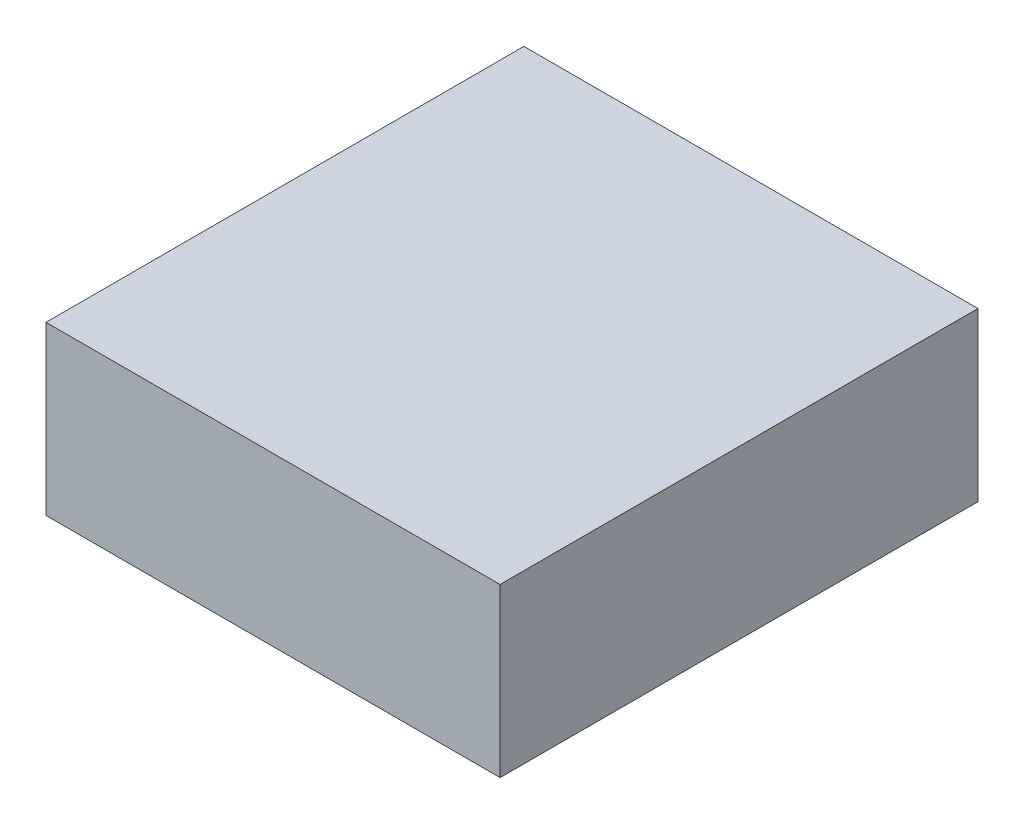
ISO-10303-21;
HEADER;
FILE_DESCRIPTION(('STEP AP214'),'2;1');
FILE_NAME('part.step','',(''),(''),'','','');
FILE_SCHEMA(('AUTOMOTIVE_DESIGN { 1 0 10303 214 1 1 1 1 }'));
ENDSEC;
DATA;
#1=APPLICATION_CONTEXT('core data for automotive mechanical design processes');
#2=APPLICATION_PROTOCOL_DEFINITION('international standard','automotive_design',2000,#1);
#3=PRODUCT_CONTEXT('',#1,'mechanical');
#4=PRODUCT('Part','Part','',(#3));
#5=PRODUCT_RELATED_PRODUCT_CATEGORY('part','',(#4));
#6=PRODUCT_DEFINITION_FORMATION('','',#4);
#7=PRODUCT_DEFINITION_CONTEXT('part definition',#1,'design');
#8=PRODUCT_DEFINITION('design','',#6,#7);
#9=PRODUCT_DEFINITION_SHAPE('','',#8);
#10=(LENGTH_UNIT() NAMED_UNIT(*) SI_UNIT(.MILLI.,.METRE.));
#11=(NAMED_UNIT(*) PLANE_ANGLE_UNIT() SI_UNIT($,.RADIAN.));
#12=(NAMED_UNIT(*) SI_UNIT($,.STERADIAN.) SOLID_ANGLE_UNIT());
#13=UNCERTAINTY_MEASURE_WITH_UNIT(LENGTH_MEASURE(1.E-05),#10,'distance_accuracy_value','');
#14=(GEOMETRIC_REPRESENTATION_CONTEXT(3) GLOBAL_UNCERTAINTY_ASSIGNED_CONTEXT((#13)) GLOBAL_UNIT_ASSIGNED_CONTEXT((#10,
#11,#12)) REPRESENTATION_CONTEXT('',''));
#15=CARTESIAN_POINT('',(0.,0.,0.));
#16=DIRECTION('',(0.,0.,1.));
#17=DIRECTION('',(1.,0.,0.));
#18=AXIS2_PLACEMENT_3D('',#15,#16,#17);
#19=CARTESIAN_POINT('',(0.47500032,0.17500092,0.));
#20=DIRECTION('',(0.,-1.,0.));
#21=DIRECTION('',(0.,0.,-1.));
#22=AXIS2_PLACEMENT_3D('',#19,#20,#21);
#23=PLANE('',#22);
#24=DIRECTION('',(0.,0.,-1.));
#25=VECTOR('',#24,1.);
#26=CARTESIAN_POINT('',(-0.47499778,0.17500092,0.));
#27=LINE('',#26,#25);
#28=CARTESIAN_POINT('',(-0.47499778,0.17500092,0.));
#29=VERTEX_POINT('',#28);
#30=CARTESIAN_POINT('',(-0.47499778,0.17500092,1.00000054));
#31=VERTEX_POINT('',#30);
#32=EDGE_CURVE('E20',#29,#31,#27,.F.);
#33=ORIENTED_EDGE('',*,*,#32,.T.);
#34=DIRECTION('',(-1.,0.,0.));
#35=VECTOR('',#34,1.);
#36=CARTESIAN_POINT('',(-0.47499778,0.17500092,1.00000054));
#37=LINE('',#36,#35);
#38=CARTESIAN_POINT('',(0.47500032,0.17500092,1.00000054));
#39=VERTEX_POINT('',#38);
#40=EDGE_CURVE('E55',#31,#39,#37,.F.);
#41=ORIENTED_EDGE('',*,*,#40,.T.);
#42=DIRECTION('',(0.,0.,1.));
#43=VECTOR('',#42,1.);
#44=CARTESIAN_POINT('',(0.47500032,0.17500092,0.));
#45=LINE('',#44,#43);
#46=CARTESIAN_POINT('',(0.47500032,0.17500092,0.));
#47=VERTEX_POINT('',#46);
#48=EDGE_CURVE('E76',#39,#47,#45,.F.);
#49=ORIENTED_EDGE('',*,*,#48,.T.);
#50=DIRECTION('',(-1.,0.,0.));
#51=VECTOR('',#50,1.);
#52=CARTESIAN_POINT('',(-0.47499778,0.17500092,0.));
#53=LINE('',#52,#51);
#54=EDGE_CURVE('E58',#29,#47,#53,.F.);
#55=ORIENTED_EDGE('',*,*,#54,.F.);
#56=EDGE_LOOP('',(#33,#41,#49,#55));
#57=FACE_BOUND('',#56,.T.);
#58=ADVANCED_FACE('F17',(#57),#23,.F.);
#59=CARTESIAN_POINT('',(-0.47499778,0.17500092,0.));
#60=DIRECTION('',(1.,0.,0.));
#61=DIRECTION('',(0.,0.,-1.));
#62=AXIS2_PLACEMENT_3D('',#59,#60,#61);
#63=PLANE('',#62);
#64=DIRECTION('',(0.,0.,1.));
#65=VECTOR('',#64,1.);
#66=CARTESIAN_POINT('',(-0.47499778,-0.17500092,0.));
#67=LINE('',#66,#65);
#68=CARTESIAN_POINT('',(-0.47499778,-0.17500092,0.));
#69=VERTEX_POINT('',#68);
#70=CARTESIAN_POINT('',(-0.47499778,-0.17500092,1.00000054));
#71=VERTEX_POINT('',#70);
#72=EDGE_CURVE('E73',#69,#71,#67,.T.);
#73=ORIENTED_EDGE('',*,*,#72,.T.);
#74=DIRECTION('',(0.,1.,0.));
#75=VECTOR('',#74,1.);
#76=CARTESIAN_POINT('',(-0.47499778,-0.17500092,1.00000054));
#77=LINE('',#76,#75);
#78=EDGE_CURVE('E63',#71,#31,#77,.T.);
#79=ORIENTED_EDGE('',*,*,#78,.T.);
#80=ORIENTED_EDGE('',*,*,#32,.F.);
#81=DIRECTION('',(0.,1.,0.));
#82=VECTOR('',#81,1.);
#83=CARTESIAN_POINT('',(-0.47499778,-0.17500092,0.));
#84=LINE('',#83,#82);
#85=EDGE_CURVE('E78',#69,#29,#84,.T.);
#86=ORIENTED_EDGE('',*,*,#85,.F.);
#87=EDGE_LOOP('',(#73,#79,#80,#86));
#88=FACE_BOUND('',#87,.T.);
#89=ADVANCED_FACE('F72',(#88),#63,.F.);
#90=CARTESIAN_POINT('',(-0.47499778,-0.17500092,1.00000054));
#91=DIRECTION('',(0.,0.,-1.));
#92=DIRECTION('',(-1.,0.,0.));
#93=AXIS2_PLACEMENT_3D('',#90,#91,#92);
#94=PLANE('',#93);
#95=DIRECTION('',(0.,1.,0.));
#96=VECTOR('',#95,1.);
#97=CARTESIAN_POINT('',(0.47500032,-0.17500092,1.00000054));
#98=LINE('',#97,#96);
#99=CARTESIAN_POINT('',(0.47500032,-0.17500092,1.00000054));
#100=VERTEX_POINT('',#99);
#101=EDGE_CURVE('E69',#100,#39,#98,.T.);
#102=ORIENTED_EDGE('',*,*,#101,.T.);
#103=ORIENTED_EDGE('',*,*,#40,.F.);
#104=ORIENTED_EDGE('',*,*,#78,.F.);
#105=DIRECTION('',(1.,0.,0.));
#106=VECTOR('',#105,1.);
#107=CARTESIAN_POINT('',(-0.47499778,-0.17500092,1.00000054));
#108=LINE('',#107,#106);
#109=EDGE_CURVE('E83',#71,#100,#108,.T.);
#110=ORIENTED_EDGE('',*,*,#109,.T.);
#111=EDGE_LOOP('',(#102,#103,#104,#110));
#112=FACE_BOUND('',#111,.T.);
#113=ADVANCED_FACE('F66',(#112),#94,.F.);
#114=CARTESIAN_POINT('',(0.47500032,-0.17500092,0.));
#115=DIRECTION('',(-1.,0.,0.));
#116=DIRECTION('',(0.,0.,1.));
#117=AXIS2_PLACEMENT_3D('',#114,#115,#116);
#118=PLANE('',#117);
#119=ORIENTED_EDGE('',*,*,#48,.F.);
#120=ORIENTED_EDGE('',*,*,#101,.F.);
#121=DIRECTION('',(0.,0.,1.));
#122=VECTOR('',#121,1.);
#123=CARTESIAN_POINT('',(0.47500032,-0.17500092,0.));
#124=LINE('',#123,#122);
#125=CARTESIAN_POINT('',(0.47500032,-0.17500092,0.));
#126=VERTEX_POINT('',#125);
#127=EDGE_CURVE('E26',#100,#126,#124,.F.);
#128=ORIENTED_EDGE('',*,*,#127,.T.);
#129=DIRECTION('',(0.,1.,0.));
#130=VECTOR('',#129,1.);
#131=CARTESIAN_POINT('',(0.47500032,-0.17500092,0.));
#132=LINE('',#131,#130);
#133=EDGE_CURVE('E34',#47,#126,#132,.F.);
#134=ORIENTED_EDGE('',*,*,#133,.F.);
#135=EDGE_LOOP('',(#119,#120,#128,#134));
#136=FACE_BOUND('',#135,.T.);
#137=ADVANCED_FACE('F88',(#136),#118,.F.);
#138=CARTESIAN_POINT('',(-0.47499778,-0.17500092,0.));
#139=DIRECTION('',(0.,0.,-1.));
#140=DIRECTION('',(-1.,0.,0.));
#141=AXIS2_PLACEMENT_3D('',#138,#139,#140);
#142=PLANE('',#141);
#143=ORIENTED_EDGE('',*,*,#133,.T.);
#144=DIRECTION('',(1.,0.,0.));
#145=VECTOR('',#144,1.);
#146=CARTESIAN_POINT('',(-0.47499778,-0.17500092,0.));
#147=LINE('',#146,#145);
#148=EDGE_CURVE('E11',#126,#69,#147,.F.);
#149=ORIENTED_EDGE('',*,*,#148,.T.);
#150=ORIENTED_EDGE('',*,*,#85,.T.);
#151=ORIENTED_EDGE('',*,*,#54,.T.);
#152=EDGE_LOOP('',(#143,#149,#150,#151));
#153=FACE_BOUND('',#152,.T.);
#154=ADVANCED_FACE('F91',(#153),#142,.T.);
#155=CARTESIAN_POINT('',(-0.47499778,-0.17500092,0.));
#156=DIRECTION('',(0.,1.,0.));
#157=DIRECTION('',(0.,0.,1.));
#158=AXIS2_PLACEMENT_3D('',#155,#156,#157);
#159=PLANE('',#158);
#160=ORIENTED_EDGE('',*,*,#127,.F.);
#161=ORIENTED_EDGE('',*,*,#109,.F.);
#162=ORIENTED_EDGE('',*,*,#72,.F.);
#163=ORIENTED_EDGE('',*,*,#148,.F.);
#164=EDGE_LOOP('',(#160,#161,#162,#163));
#165=FACE_BOUND('',#164,.T.);
#166=ADVANCED_FACE('F90',(#165),#159,.F.);
#167=CLOSED_SHELL('',(#58,#89,#113,#137,#154,#166));
#168=MANIFOLD_SOLID_BREP('B1',#167);
#169=ADVANCED_BREP_SHAPE_REPRESENTATION('',(#18,#168),#14);
#170=SHAPE_DEFINITION_REPRESENTATION(#9,#169);
ENDSEC;
END-ISO-10303-21;
